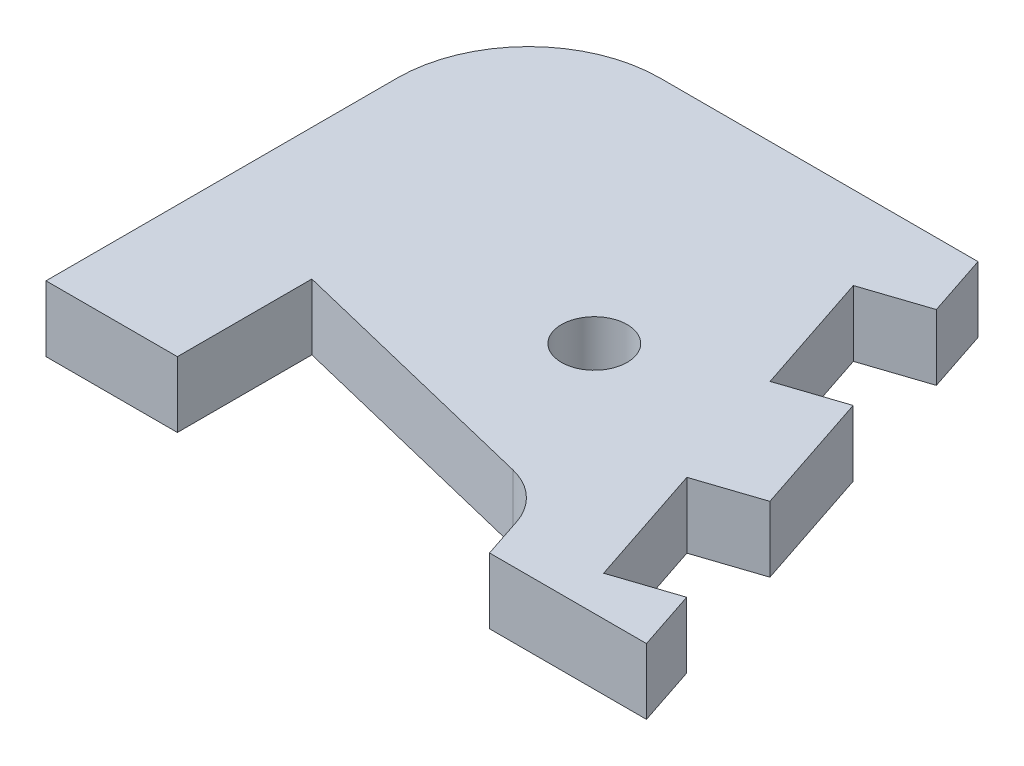
ISO-10303-21;
HEADER;
FILE_DESCRIPTION(('STEP AP214'),'2;1');
FILE_NAME('part.step','',(''),(''),'','','');
FILE_SCHEMA(('AUTOMOTIVE_DESIGN { 1 0 10303 214 1 1 1 1 }'));
ENDSEC;
DATA;
#1=APPLICATION_CONTEXT('core data for automotive mechanical design processes');
#2=APPLICATION_PROTOCOL_DEFINITION('international standard','automotive_design',2000,#1);
#3=PRODUCT_CONTEXT('',#1,'mechanical');
#4=PRODUCT('Part','Part','',(#3));
#5=PRODUCT_RELATED_PRODUCT_CATEGORY('part','',(#4));
#6=PRODUCT_DEFINITION_FORMATION('','',#4);
#7=PRODUCT_DEFINITION_CONTEXT('part definition',#1,'design');
#8=PRODUCT_DEFINITION('design','',#6,#7);
#9=PRODUCT_DEFINITION_SHAPE('','',#8);
#10=(LENGTH_UNIT() NAMED_UNIT(*) SI_UNIT(.MILLI.,.METRE.));
#11=(NAMED_UNIT(*) PLANE_ANGLE_UNIT() SI_UNIT($,.RADIAN.));
#12=(NAMED_UNIT(*) SI_UNIT($,.STERADIAN.) SOLID_ANGLE_UNIT());
#13=UNCERTAINTY_MEASURE_WITH_UNIT(LENGTH_MEASURE(1.E-05),#10,'distance_accuracy_value','');
#14=(GEOMETRIC_REPRESENTATION_CONTEXT(3) GLOBAL_UNCERTAINTY_ASSIGNED_CONTEXT((#13)) GLOBAL_UNIT_ASSIGNED_CONTEXT((#10,
#11,#12)) REPRESENTATION_CONTEXT('',''));
#15=CARTESIAN_POINT('',(0.,0.,0.));
#16=DIRECTION('',(0.,0.,1.));
#17=DIRECTION('',(1.,0.,0.));
#18=AXIS2_PLACEMENT_3D('',#15,#16,#17);
#19=CARTESIAN_POINT('',(43.5360100522409,10.,35.5951480288893));
#20=DIRECTION('',(-0.948960459172505,0.,0.315395064842665));
#21=DIRECTION('',(0.315395064842665,0.,0.948960459172505));
#22=AXIS2_PLACEMENT_3D('',#19,#20,#21);
#23=PLANE('',#22);
#24=DIRECTION('',(-0.315395064842665,0.,-0.948960459172505));
#25=VECTOR('',#24,1.);
#26=CARTESIAN_POINT('',(43.5360100522409,0.,35.5951480288893));
#27=LINE('',#26,#25);
#28=CARTESIAN_POINT('',(43.5360100522409,0.,35.5951480288893));
#29=VERTEX_POINT('',#28);
#30=CARTESIAN_POINT('',(40.4889753758803,0.,26.4272321420753));
#31=VERTEX_POINT('',#30);
#32=EDGE_CURVE('E185',#29,#31,#27,.T.);
#33=ORIENTED_EDGE('',*,*,#32,.T.);
#34=DIRECTION('',(0.,1.,0.));
#35=VECTOR('',#34,1.);
#36=CARTESIAN_POINT('',(40.4889753758803,0.,26.4272321420753));
#37=LINE('',#36,#35);
#38=CARTESIAN_POINT('',(40.4889753758803,10.,26.4272321420753));
#39=VERTEX_POINT('',#38);
#40=EDGE_CURVE('E276',#31,#39,#37,.T.);
#41=ORIENTED_EDGE('',*,*,#40,.T.);
#42=DIRECTION('',(-0.315395064842665,0.,-0.948960459172505));
#43=VECTOR('',#42,1.);
#44=CARTESIAN_POINT('',(43.5360100522409,10.,35.5951480288893));
#45=LINE('',#44,#43);
#46=CARTESIAN_POINT('',(43.5360100522409,10.,35.5951480288893));
#47=VERTEX_POINT('',#46);
#48=EDGE_CURVE('E263',#47,#39,#45,.T.);
#49=ORIENTED_EDGE('',*,*,#48,.F.);
#50=DIRECTION('',(0.,-1.,0.));
#51=VECTOR('',#50,1.);
#52=CARTESIAN_POINT('',(43.5360100522409,10.,35.5951480288893));
#53=LINE('',#52,#51);
#54=EDGE_CURVE('E199',#47,#29,#53,.T.);
#55=ORIENTED_EDGE('',*,*,#54,.T.);
#56=EDGE_LOOP('',(#33,#41,#49,#55));
#57=FACE_BOUND('',#56,.T.);
#58=ADVANCED_FACE('F33',(#57),#23,.F.);
#59=CARTESIAN_POINT('',(34.181074079027,10.,7.44802295862521));
#60=VERTEX_POINT('',#59);
#61=CARTESIAN_POINT('',(27.8731727821737,10.,-11.5311862248249));
#62=VERTEX_POINT('',#61);
#63=EDGE_CURVE('E176',#60,#62,#45,.T.);
#64=ORIENTED_EDGE('',*,*,#63,.F.);
#65=DIRECTION('',(0.,1.,0.));
#66=VECTOR('',#65,1.);
#67=CARTESIAN_POINT('',(34.181074079027,0.,7.44802295862521));
#68=LINE('',#67,#66);
#69=CARTESIAN_POINT('',(34.181074079027,0.,7.44802295862521));
#70=VERTEX_POINT('',#69);
#71=EDGE_CURVE('E162',#70,#60,#68,.T.);
#72=ORIENTED_EDGE('',*,*,#71,.F.);
#73=CARTESIAN_POINT('',(27.8731727821737,0.,-11.5311862248249));
#74=VERTEX_POINT('',#73);
#75=EDGE_CURVE('E174',#70,#74,#27,.T.);
#76=ORIENTED_EDGE('',*,*,#75,.T.);
#77=DIRECTION('',(0.,1.,0.));
#78=VECTOR('',#77,1.);
#79=CARTESIAN_POINT('',(27.8731727821737,0.,-11.5311862248249));
#80=LINE('',#79,#78);
#81=EDGE_CURVE('E297',#74,#62,#80,.T.);
#82=ORIENTED_EDGE('',*,*,#81,.T.);
#83=EDGE_LOOP('',(#64,#72,#76,#82));
#84=FACE_BOUND('',#83,.T.);
#85=ADVANCED_FACE('F172',(#84),#23,.F.);
#86=CARTESIAN_POINT('',(8.10437226417191,10.,32.5780480350778));
#87=DIRECTION('',(0.,-1.,0.));
#88=DIRECTION('',(0.,0.,-1.));
#89=AXIS2_PLACEMENT_3D('',#86,#87,#88);
#90=PLANE('',#89);
#91=DIRECTION('',(-1.,0.,0.));
#92=VECTOR('',#91,1.);
#93=CARTESIAN_POINT('',(-50.,10.,-40.));
#94=LINE('',#93,#92);
#95=CARTESIAN_POINT('',(18.4113208368937,10.,-40.));
#96=VERTEX_POINT('',#95);
#97=CARTESIAN_POINT('',(-30.,10.,-40.));
#98=VERTEX_POINT('',#97);
#99=EDGE_CURVE('E200',#96,#98,#94,.T.);
#100=ORIENTED_EDGE('',*,*,#99,.T.);
#101=CARTESIAN_POINT('',(-30.,10.,-20.));
#102=DIRECTION('',(0.,-1.,0.));
#103=DIRECTION('',(0.,0.,-1.));
#104=AXIS2_PLACEMENT_3D('',#101,#102,#103);
#105=CIRCLE('',#104,20.);
#106=CARTESIAN_POINT('',(-50.,10.,-20.));
#107=VERTEX_POINT('',#106);
#108=EDGE_CURVE('E11',#98,#107,#105,.F.);
#109=ORIENTED_EDGE('',*,*,#108,.T.);
#110=DIRECTION('',(0.,0.,1.));
#111=VECTOR('',#110,1.);
#112=CARTESIAN_POINT('',(-50.,10.,-40.));
#113=LINE('',#112,#111);
#114=CARTESIAN_POINT('',(-50.,10.,33.4741605090196));
#115=VERTEX_POINT('',#114);
#116=EDGE_CURVE('E195',#107,#115,#113,.T.);
#117=ORIENTED_EDGE('',*,*,#116,.T.);
#118=DIRECTION('',(1.,0.,0.));
#119=VECTOR('',#118,1.);
#120=CARTESIAN_POINT('',(-50.,10.,33.4741605090196));
#121=LINE('',#120,#119);
#122=CARTESIAN_POINT('',(-29.9999999999998,10.,33.4741605090196));
#123=VERTEX_POINT('',#122);
#124=EDGE_CURVE('E307',#115,#123,#121,.T.);
#125=ORIENTED_EDGE('',*,*,#124,.T.);
#126=DIRECTION('',(0.,0.,-1.));
#127=VECTOR('',#126,1.);
#128=CARTESIAN_POINT('',(-29.9999999999998,10.,13.));
#129=LINE('',#128,#127);
#130=CARTESIAN_POINT('',(-29.9999999999998,10.,13.));
#131=VERTEX_POINT('',#130);
#132=EDGE_CURVE('E309',#123,#131,#129,.T.);
#133=ORIENTED_EDGE('',*,*,#132,.T.);
#134=DIRECTION('',(0.971569206394266,0.,0.236755733164829));
#135=VECTOR('',#134,1.);
#136=CARTESIAN_POINT('',(-29.9999999999998,10.,13.));
#137=LINE('',#136,#135);
#138=CARTESIAN_POINT('',(10.4719295958201,10.,22.8623559711352));
#139=VERTEX_POINT('',#138);
#140=EDGE_CURVE('E311',#131,#139,#137,.T.);
#141=ORIENTED_EDGE('',*,*,#140,.T.);
#142=CARTESIAN_POINT('',(8.10437226417191,10.,32.5780480350778));
#143=DIRECTION('',(0.,-1.,0.));
#144=DIRECTION('',(0.,0.,-1.));
#145=AXIS2_PLACEMENT_3D('',#142,#143,#144);
#146=CIRCLE('',#145,9.99999999999988);
#147=CARTESIAN_POINT('',(17.5939768558969,10.,29.4240973866513));
#148=VERTEX_POINT('',#147);
#149=EDGE_CURVE('E313',#139,#148,#146,.T.);
#150=ORIENTED_EDGE('',*,*,#149,.T.);
#151=DIRECTION('',(0.315395064842665,0.,0.948960459172504));
#152=VECTOR('',#151,1.);
#153=CARTESIAN_POINT('',(17.5939768558969,10.,29.4240973866513));
#154=LINE('',#153,#152);
#155=CARTESIAN_POINT('',(19.6449779262188,10.,35.5951480288893));
#156=VERTEX_POINT('',#155);
#157=EDGE_CURVE('E315',#148,#156,#154,.T.);
#158=ORIENTED_EDGE('',*,*,#157,.T.);
#159=DIRECTION('',(1.,0.,0.));
#160=VECTOR('',#159,1.);
#161=CARTESIAN_POINT('',(19.6449779262188,10.,35.5951480288893));
#162=LINE('',#161,#160);
#163=EDGE_CURVE('E317',#156,#47,#162,.T.);
#164=ORIENTED_EDGE('',*,*,#163,.T.);
#165=ORIENTED_EDGE('',*,*,#48,.T.);
#166=DIRECTION('',(0.948960459172505,0.,-0.315395064842665));
#167=VECTOR('',#166,1.);
#168=CARTESIAN_POINT('',(30.9993707841552,10.,29.581182790502));
#169=LINE('',#168,#167);
#170=CARTESIAN_POINT('',(30.9993707841552,10.,29.581182790502));
#171=VERTEX_POINT('',#170);
#172=EDGE_CURVE('E168',#171,#39,#169,.T.);
#173=ORIENTED_EDGE('',*,*,#172,.F.);
#174=DIRECTION('',(0.315395064842665,0.,0.948960459172505));
#175=VECTOR('',#174,1.);
#176=CARTESIAN_POINT('',(24.6914694873019,10.,10.6019736070519));
#177=LINE('',#176,#175);
#178=CARTESIAN_POINT('',(24.6914694873019,10.,10.6019736070519));
#179=VERTEX_POINT('',#178);
#180=EDGE_CURVE('E272',#179,#171,#177,.T.);
#181=ORIENTED_EDGE('',*,*,#180,.F.);
#182=DIRECTION('',(-0.948960459172505,0.,0.315395064842665));
#183=VECTOR('',#182,1.);
#184=CARTESIAN_POINT('',(34.181074079027,10.,7.44802295862521));
#185=LINE('',#184,#183);
#186=EDGE_CURVE('E270',#60,#179,#185,.T.);
#187=ORIENTED_EDGE('',*,*,#186,.F.);
#188=ORIENTED_EDGE('',*,*,#63,.T.);
#189=DIRECTION('',(0.948960459172505,0.,-0.315395064842665));
#190=VECTOR('',#189,1.);
#191=CARTESIAN_POINT('',(18.3835681904486,10.,-8.37723557639823));
#192=LINE('',#191,#190);
#193=CARTESIAN_POINT('',(18.3835681904486,10.,-8.37723557639823));
#194=VERTEX_POINT('',#193);
#195=EDGE_CURVE('E286',#194,#62,#192,.T.);
#196=ORIENTED_EDGE('',*,*,#195,.F.);
#197=DIRECTION('',(0.315395064842665,0.,0.948960459172505));
#198=VECTOR('',#197,1.);
#199=CARTESIAN_POINT('',(12.0756668935953,10.,-27.3564447598483));
#200=LINE('',#199,#198);
#201=CARTESIAN_POINT('',(12.0756668935953,10.,-27.3564447598483));
#202=VERTEX_POINT('',#201);
#203=EDGE_CURVE('E292',#202,#194,#200,.T.);
#204=ORIENTED_EDGE('',*,*,#203,.F.);
#205=DIRECTION('',(-0.948960459172505,0.,0.315395064842665));
#206=VECTOR('',#205,1.);
#207=CARTESIAN_POINT('',(21.5652714853204,10.,-30.510395408275));
#208=LINE('',#207,#206);
#209=CARTESIAN_POINT('',(21.5652714853204,10.,-30.510395408275));
#210=VERTEX_POINT('',#209);
#211=EDGE_CURVE('E278',#210,#202,#208,.T.);
#212=ORIENTED_EDGE('',*,*,#211,.F.);
#213=EDGE_CURVE('E318',#210,#96,#45,.T.);
#214=ORIENTED_EDGE('',*,*,#213,.T.);
#215=EDGE_LOOP('',(#100,#109,#117,#125,#133,#141,#150,#158,#164,#165,#173,#181,#187,#188,#196,
#204,#212,#214));
#216=FACE_BOUND('',#215,.T.);
#217=CARTESIAN_POINT('',(0.,10.,0.));
#218=DIRECTION('',(0.,1.,0.));
#219=DIRECTION('',(0.,0.,1.));
#220=AXIS2_PLACEMENT_3D('',#217,#218,#219);
#221=CIRCLE('',#220,5.);
#222=CARTESIAN_POINT('',(0.,10.,5.));
#223=VERTEX_POINT('',#222);
#224=EDGE_CURVE('E235',#223,#223,#221,.T.);
#225=ORIENTED_EDGE('',*,*,#224,.F.);
#226=EDGE_LOOP('',(#225));
#227=FACE_BOUND('',#226,.T.);
#228=ADVANCED_FACE('F324',(#216,#227),#90,.F.);
#229=CARTESIAN_POINT('',(8.10437226417191,0.,32.5780480350778));
#230=DIRECTION('',(0.,-1.,0.));
#231=DIRECTION('',(0.,0.,-1.));
#232=AXIS2_PLACEMENT_3D('',#229,#230,#231);
#233=PLANE('',#232);
#234=DIRECTION('',(0.,0.,1.));
#235=VECTOR('',#234,1.);
#236=CARTESIAN_POINT('',(-50.,0.,13.));
#237=LINE('',#236,#235);
#238=CARTESIAN_POINT('',(-50.,0.,-20.));
#239=VERTEX_POINT('',#238);
#240=CARTESIAN_POINT('',(-50.,0.,33.4741605090196));
#241=VERTEX_POINT('',#240);
#242=EDGE_CURVE('E229',#239,#241,#237,.T.);
#243=ORIENTED_EDGE('',*,*,#242,.F.);
#244=CARTESIAN_POINT('',(-30.,0.,-20.));
#245=DIRECTION('',(0.,-1.,0.));
#246=DIRECTION('',(0.,0.,-1.));
#247=AXIS2_PLACEMENT_3D('',#244,#245,#246);
#248=CIRCLE('',#247,20.);
#249=CARTESIAN_POINT('',(-30.,0.,-40.));
#250=VERTEX_POINT('',#249);
#251=EDGE_CURVE('E55',#239,#250,#248,.T.);
#252=ORIENTED_EDGE('',*,*,#251,.T.);
#253=DIRECTION('',(-1.,0.,0.));
#254=VECTOR('',#253,1.);
#255=CARTESIAN_POINT('',(-50.,0.,-40.));
#256=LINE('',#255,#254);
#257=CARTESIAN_POINT('',(18.4113208368937,0.,-40.));
#258=VERTEX_POINT('',#257);
#259=EDGE_CURVE('E189',#258,#250,#256,.T.);
#260=ORIENTED_EDGE('',*,*,#259,.F.);
#261=CARTESIAN_POINT('',(21.5652714853204,0.,-30.510395408275));
#262=VERTEX_POINT('',#261);
#263=EDGE_CURVE('E186',#262,#258,#27,.T.);
#264=ORIENTED_EDGE('',*,*,#263,.F.);
#265=DIRECTION('',(-0.948960459172505,0.,0.315395064842665));
#266=VECTOR('',#265,1.);
#267=CARTESIAN_POINT('',(21.5652714853204,0.,-30.510395408275));
#268=LINE('',#267,#266);
#269=CARTESIAN_POINT('',(12.0756668935953,0.,-27.3564447598483));
#270=VERTEX_POINT('',#269);
#271=EDGE_CURVE('E282',#262,#270,#268,.T.);
#272=ORIENTED_EDGE('',*,*,#271,.T.);
#273=DIRECTION('',(0.315395064842665,0.,0.948960459172505));
#274=VECTOR('',#273,1.);
#275=CARTESIAN_POINT('',(12.0756668935953,0.,-27.3564447598483));
#276=LINE('',#275,#274);
#277=CARTESIAN_POINT('',(18.3835681904486,0.,-8.37723557639823));
#278=VERTEX_POINT('',#277);
#279=EDGE_CURVE('E285',#270,#278,#276,.T.);
#280=ORIENTED_EDGE('',*,*,#279,.T.);
#281=DIRECTION('',(0.948960459172505,0.,-0.315395064842665));
#282=VECTOR('',#281,1.);
#283=CARTESIAN_POINT('',(18.3835681904486,0.,-8.37723557639823));
#284=LINE('',#283,#282);
#285=EDGE_CURVE('E184',#278,#74,#284,.T.);
#286=ORIENTED_EDGE('',*,*,#285,.T.);
#287=ORIENTED_EDGE('',*,*,#75,.F.);
#288=DIRECTION('',(-0.948960459172505,0.,0.315395064842665));
#289=VECTOR('',#288,1.);
#290=CARTESIAN_POINT('',(34.181074079027,0.,7.44802295862521));
#291=LINE('',#290,#289);
#292=CARTESIAN_POINT('',(24.6914694873019,0.,10.6019736070519));
#293=VERTEX_POINT('',#292);
#294=EDGE_CURVE('E158',#70,#293,#291,.T.);
#295=ORIENTED_EDGE('',*,*,#294,.T.);
#296=DIRECTION('',(0.315395064842665,0.,0.948960459172505));
#297=VECTOR('',#296,1.);
#298=CARTESIAN_POINT('',(24.6914694873019,0.,10.6019736070519));
#299=LINE('',#298,#297);
#300=CARTESIAN_POINT('',(30.9993707841552,0.,29.581182790502));
#301=VERTEX_POINT('',#300);
#302=EDGE_CURVE('E167',#293,#301,#299,.T.);
#303=ORIENTED_EDGE('',*,*,#302,.T.);
#304=DIRECTION('',(0.948960459172505,0.,-0.315395064842665));
#305=VECTOR('',#304,1.);
#306=CARTESIAN_POINT('',(30.9993707841552,0.,29.581182790502));
#307=LINE('',#306,#305);
#308=EDGE_CURVE('E177',#301,#31,#307,.T.);
#309=ORIENTED_EDGE('',*,*,#308,.T.);
#310=ORIENTED_EDGE('',*,*,#32,.F.);
#311=DIRECTION('',(1.,0.,0.));
#312=VECTOR('',#311,1.);
#313=CARTESIAN_POINT('',(19.6449779262188,0.,35.5951480288893));
#314=LINE('',#313,#312);
#315=CARTESIAN_POINT('',(19.6449779262188,0.,35.5951480288893));
#316=VERTEX_POINT('',#315);
#317=EDGE_CURVE('E190',#316,#29,#314,.T.);
#318=ORIENTED_EDGE('',*,*,#317,.F.);
#319=DIRECTION('',(0.315395064842665,0.,0.948960459172504));
#320=VECTOR('',#319,1.);
#321=CARTESIAN_POINT('',(17.5939768558969,0.,29.4240973866513));
#322=LINE('',#321,#320);
#323=CARTESIAN_POINT('',(17.5939768558969,0.,29.4240973866513));
#324=VERTEX_POINT('',#323);
#325=EDGE_CURVE('E249',#324,#316,#322,.T.);
#326=ORIENTED_EDGE('',*,*,#325,.F.);
#327=CARTESIAN_POINT('',(8.10437226417191,0.,32.5780480350778));
#328=DIRECTION('',(0.,-1.,0.));
#329=DIRECTION('',(0.,0.,-1.));
#330=AXIS2_PLACEMENT_3D('',#327,#328,#329);
#331=CIRCLE('',#330,9.99999999999988);
#332=CARTESIAN_POINT('',(10.4719295958201,0.,22.8623559711352));
#333=VERTEX_POINT('',#332);
#334=EDGE_CURVE('E248',#333,#324,#331,.T.);
#335=ORIENTED_EDGE('',*,*,#334,.F.);
#336=DIRECTION('',(0.971569206394266,0.,0.236755733164829));
#337=VECTOR('',#336,1.);
#338=CARTESIAN_POINT('',(-29.9999999999998,0.,13.));
#339=LINE('',#338,#337);
#340=CARTESIAN_POINT('',(-29.9999999999998,0.,13.));
#341=VERTEX_POINT('',#340);
#342=EDGE_CURVE('E246',#341,#333,#339,.T.);
#343=ORIENTED_EDGE('',*,*,#342,.F.);
#344=DIRECTION('',(0.,0.,-1.));
#345=VECTOR('',#344,1.);
#346=CARTESIAN_POINT('',(-29.9999999999998,0.,13.));
#347=LINE('',#346,#345);
#348=CARTESIAN_POINT('',(-29.9999999999998,0.,33.4741605090196));
#349=VERTEX_POINT('',#348);
#350=EDGE_CURVE('E237',#349,#341,#347,.T.);
#351=ORIENTED_EDGE('',*,*,#350,.F.);
#352=DIRECTION('',(1.,0.,0.));
#353=VECTOR('',#352,1.);
#354=CARTESIAN_POINT('',(-50.,0.,33.4741605090196));
#355=LINE('',#354,#353);
#356=EDGE_CURVE('E234',#241,#349,#355,.T.);
#357=ORIENTED_EDGE('',*,*,#356,.F.);
#358=EDGE_LOOP('',(#243,#252,#260,#264,#272,#280,#286,#287,#295,#303,#309,#310,#318,#326,#335,
#343,#351,#357));
#359=FACE_BOUND('',#358,.T.);
#360=CARTESIAN_POINT('',(0.,0.,0.));
#361=DIRECTION('',(0.,1.,0.));
#362=DIRECTION('',(0.,0.,1.));
#363=AXIS2_PLACEMENT_3D('',#360,#361,#362);
#364=CIRCLE('',#363,5.);
#365=CARTESIAN_POINT('',(0.,0.,5.));
#366=VERTEX_POINT('',#365);
#367=EDGE_CURVE('E240',#366,#366,#364,.T.);
#368=ORIENTED_EDGE('',*,*,#367,.T.);
#369=EDGE_LOOP('',(#368));
#370=FACE_BOUND('',#369,.T.);
#371=ADVANCED_FACE('F180',(#359,#370),#233,.T.);
#372=CARTESIAN_POINT('',(-50.,10.,13.));
#373=DIRECTION('',(1.,0.,0.));
#374=DIRECTION('',(0.,0.,-1.));
#375=AXIS2_PLACEMENT_3D('',#372,#373,#374);
#376=PLANE('',#375);
#377=ORIENTED_EDGE('',*,*,#116,.F.);
#378=DIRECTION('',(0.,-1.,0.));
#379=VECTOR('',#378,1.);
#380=CARTESIAN_POINT('',(-50.,10.,-20.));
#381=LINE('',#380,#379);
#382=EDGE_CURVE('E221',#107,#239,#381,.T.);
#383=ORIENTED_EDGE('',*,*,#382,.T.);
#384=ORIENTED_EDGE('',*,*,#242,.T.);
#385=DIRECTION('',(0.,-1.,0.));
#386=VECTOR('',#385,1.);
#387=CARTESIAN_POINT('',(-50.,10.,33.4741605090196));
#388=LINE('',#387,#386);
#389=EDGE_CURVE('E218',#115,#241,#388,.T.);
#390=ORIENTED_EDGE('',*,*,#389,.F.);
#391=EDGE_LOOP('',(#377,#383,#384,#390));
#392=FACE_BOUND('',#391,.T.);
#393=ADVANCED_FACE('F227',(#392),#376,.F.);
#394=CARTESIAN_POINT('',(-50.,10.,33.4741605090196));
#395=DIRECTION('',(0.,0.,-1.));
#396=DIRECTION('',(-1.,0.,0.));
#397=AXIS2_PLACEMENT_3D('',#394,#395,#396);
#398=PLANE('',#397);
#399=ORIENTED_EDGE('',*,*,#356,.T.);
#400=DIRECTION('',(0.,-1.,0.));
#401=VECTOR('',#400,1.);
#402=CARTESIAN_POINT('',(-29.9999999999998,10.,33.4741605090196));
#403=LINE('',#402,#401);
#404=EDGE_CURVE('E215',#123,#349,#403,.T.);
#405=ORIENTED_EDGE('',*,*,#404,.F.);
#406=ORIENTED_EDGE('',*,*,#124,.F.);
#407=ORIENTED_EDGE('',*,*,#389,.T.);
#408=EDGE_LOOP('',(#399,#405,#406,#407));
#409=FACE_BOUND('',#408,.T.);
#410=ADVANCED_FACE('F365',(#409),#398,.F.);
#411=CARTESIAN_POINT('',(-29.9999999999998,10.,13.));
#412=DIRECTION('',(-1.,0.,0.));
#413=DIRECTION('',(0.,0.,1.));
#414=AXIS2_PLACEMENT_3D('',#411,#412,#413);
#415=PLANE('',#414);
#416=ORIENTED_EDGE('',*,*,#350,.T.);
#417=DIRECTION('',(0.,-1.,0.));
#418=VECTOR('',#417,1.);
#419=CARTESIAN_POINT('',(-29.9999999999998,10.,13.));
#420=LINE('',#419,#418);
#421=EDGE_CURVE('E212',#131,#341,#420,.T.);
#422=ORIENTED_EDGE('',*,*,#421,.F.);
#423=ORIENTED_EDGE('',*,*,#132,.F.);
#424=ORIENTED_EDGE('',*,*,#404,.T.);
#425=EDGE_LOOP('',(#416,#422,#423,#424));
#426=FACE_BOUND('',#425,.T.);
#427=ADVANCED_FACE('F361',(#426),#415,.F.);
#428=CARTESIAN_POINT('',(-29.9999999999998,10.,13.));
#429=DIRECTION('',(0.236755733164829,0.,-0.971569206394266));
#430=DIRECTION('',(-0.971569206394266,0.,-0.236755733164829));
#431=AXIS2_PLACEMENT_3D('',#428,#429,#430);
#432=PLANE('',#431);
#433=ORIENTED_EDGE('',*,*,#342,.T.);
#434=DIRECTION('',(0.,-1.,0.));
#435=VECTOR('',#434,1.);
#436=CARTESIAN_POINT('',(10.4719295958201,10.,22.8623559711352));
#437=LINE('',#436,#435);
#438=EDGE_CURVE('E209',#139,#333,#437,.T.);
#439=ORIENTED_EDGE('',*,*,#438,.F.);
#440=ORIENTED_EDGE('',*,*,#140,.F.);
#441=ORIENTED_EDGE('',*,*,#421,.T.);
#442=EDGE_LOOP('',(#433,#439,#440,#441));
#443=FACE_BOUND('',#442,.T.);
#444=ADVANCED_FACE('F357',(#443),#432,.F.);
#445=CARTESIAN_POINT('',(8.10437226417191,10.,32.5780480350778));
#446=DIRECTION('',(0.,-1.,0.));
#447=DIRECTION('',(0.,0.,-1.));
#448=AXIS2_PLACEMENT_3D('',#445,#446,#447);
#449=CYLINDRICAL_SURFACE('',#448,9.99999999999988);
#450=ORIENTED_EDGE('',*,*,#334,.T.);
#451=DIRECTION('',(0.,-1.,0.));
#452=VECTOR('',#451,1.);
#453=CARTESIAN_POINT('',(17.5939768558969,10.,29.4240973866513));
#454=LINE('',#453,#452);
#455=EDGE_CURVE('E206',#148,#324,#454,.T.);
#456=ORIENTED_EDGE('',*,*,#455,.F.);
#457=ORIENTED_EDGE('',*,*,#149,.F.);
#458=ORIENTED_EDGE('',*,*,#438,.T.);
#459=EDGE_LOOP('',(#450,#456,#457,#458));
#460=FACE_BOUND('',#459,.T.);
#461=ADVANCED_FACE('F354',(#460),#449,.F.);
#462=CARTESIAN_POINT('',(17.5939768558969,10.,29.4240973866513));
#463=DIRECTION('',(0.948960459172505,0.,-0.315395064842665));
#464=DIRECTION('',(-0.315395064842665,0.,-0.948960459172505));
#465=AXIS2_PLACEMENT_3D('',#462,#463,#464);
#466=PLANE('',#465);
#467=ORIENTED_EDGE('',*,*,#325,.T.);
#468=DIRECTION('',(0.,-1.,0.));
#469=VECTOR('',#468,1.);
#470=CARTESIAN_POINT('',(19.6449779262188,10.,35.5951480288893));
#471=LINE('',#470,#469);
#472=EDGE_CURVE('E203',#156,#316,#471,.T.);
#473=ORIENTED_EDGE('',*,*,#472,.F.);
#474=ORIENTED_EDGE('',*,*,#157,.F.);
#475=ORIENTED_EDGE('',*,*,#455,.T.);
#476=EDGE_LOOP('',(#467,#473,#474,#475));
#477=FACE_BOUND('',#476,.T.);
#478=ADVANCED_FACE('F351',(#477),#466,.F.);
#479=CARTESIAN_POINT('',(19.6449779262188,10.,35.5951480288893));
#480=DIRECTION('',(0.,0.,-1.));
#481=DIRECTION('',(-1.,0.,0.));
#482=AXIS2_PLACEMENT_3D('',#479,#480,#481);
#483=PLANE('',#482);
#484=ORIENTED_EDGE('',*,*,#317,.T.);
#485=ORIENTED_EDGE('',*,*,#54,.F.);
#486=ORIENTED_EDGE('',*,*,#163,.F.);
#487=ORIENTED_EDGE('',*,*,#472,.T.);
#488=EDGE_LOOP('',(#484,#485,#486,#487));
#489=FACE_BOUND('',#488,.T.);
#490=ADVANCED_FACE('F256',(#489),#483,.F.);
#491=ORIENTED_EDGE('',*,*,#213,.F.);
#492=DIRECTION('',(0.,1.,0.));
#493=VECTOR('',#492,1.);
#494=CARTESIAN_POINT('',(21.5652714853204,0.,-30.510395408275));
#495=LINE('',#494,#493);
#496=EDGE_CURVE('E289',#262,#210,#495,.T.);
#497=ORIENTED_EDGE('',*,*,#496,.F.);
#498=ORIENTED_EDGE('',*,*,#263,.T.);
#499=DIRECTION('',(0.,-1.,0.));
#500=VECTOR('',#499,1.);
#501=CARTESIAN_POINT('',(18.4113208368937,10.,-40.));
#502=LINE('',#501,#500);
#503=EDGE_CURVE('E196',#96,#258,#502,.T.);
#504=ORIENTED_EDGE('',*,*,#503,.F.);
#505=EDGE_LOOP('',(#491,#497,#498,#504));
#506=FACE_BOUND('',#505,.T.);
#507=ADVANCED_FACE('F329',(#506),#23,.F.);
#508=CARTESIAN_POINT('',(-50.,10.,-40.));
#509=DIRECTION('',(0.,0.,1.));
#510=DIRECTION('',(1.,0.,0.));
#511=AXIS2_PLACEMENT_3D('',#508,#509,#510);
#512=PLANE('',#511);
#513=ORIENTED_EDGE('',*,*,#259,.T.);
#514=DIRECTION('',(0.,-1.,0.));
#515=VECTOR('',#514,1.);
#516=CARTESIAN_POINT('',(-30.,10.,-40.));
#517=LINE('',#516,#515);
#518=EDGE_CURVE('E41',#250,#98,#517,.F.);
#519=ORIENTED_EDGE('',*,*,#518,.T.);
#520=ORIENTED_EDGE('',*,*,#99,.F.);
#521=ORIENTED_EDGE('',*,*,#503,.T.);
#522=EDGE_LOOP('',(#513,#519,#520,#521));
#523=FACE_BOUND('',#522,.T.);
#524=ADVANCED_FACE('F331',(#523),#512,.F.);
#525=CARTESIAN_POINT('',(0.,10.,0.));
#526=DIRECTION('',(0.,-1.,0.));
#527=DIRECTION('',(0.,0.,-1.));
#528=AXIS2_PLACEMENT_3D('',#525,#526,#527);
#529=CYLINDRICAL_SURFACE('',#528,5.);
#530=ORIENTED_EDGE('',*,*,#224,.T.);
#531=EDGE_LOOP('',(#530));
#532=FACE_BOUND('',#531,.T.);
#533=ORIENTED_EDGE('',*,*,#367,.F.);
#534=EDGE_LOOP('',(#533));
#535=FACE_BOUND('',#534,.T.);
#536=ADVANCED_FACE('F333',(#532,#535),#529,.F.);
#537=CARTESIAN_POINT('',(18.3835681904486,0.,-8.37723557639823));
#538=DIRECTION('',(0.315395064842665,0.,0.948960459172505));
#539=DIRECTION('',(0.948960459172505,0.,-0.315395064842665));
#540=AXIS2_PLACEMENT_3D('',#537,#538,#539);
#541=PLANE('',#540);
#542=ORIENTED_EDGE('',*,*,#195,.T.);
#543=ORIENTED_EDGE('',*,*,#81,.F.);
#544=ORIENTED_EDGE('',*,*,#285,.F.);
#545=DIRECTION('',(0.,1.,0.));
#546=VECTOR('',#545,1.);
#547=CARTESIAN_POINT('',(18.3835681904486,0.,-8.37723557639823));
#548=LINE('',#547,#546);
#549=EDGE_CURVE('E299',#278,#194,#548,.T.);
#550=ORIENTED_EDGE('',*,*,#549,.T.);
#551=EDGE_LOOP('',(#542,#543,#544,#550));
#552=FACE_BOUND('',#551,.T.);
#553=ADVANCED_FACE('F339',(#552),#541,.F.);
#554=CARTESIAN_POINT('',(12.0756668935953,0.,-27.3564447598483));
#555=DIRECTION('',(-0.948960459172505,0.,0.315395064842665));
#556=DIRECTION('',(0.315395064842665,0.,0.948960459172505));
#557=AXIS2_PLACEMENT_3D('',#554,#555,#556);
#558=PLANE('',#557);
#559=ORIENTED_EDGE('',*,*,#203,.T.);
#560=ORIENTED_EDGE('',*,*,#549,.F.);
#561=ORIENTED_EDGE('',*,*,#279,.F.);
#562=DIRECTION('',(0.,1.,0.));
#563=VECTOR('',#562,1.);
#564=CARTESIAN_POINT('',(12.0756668935953,0.,-27.3564447598483));
#565=LINE('',#564,#563);
#566=EDGE_CURVE('E301',#270,#202,#565,.T.);
#567=ORIENTED_EDGE('',*,*,#566,.T.);
#568=EDGE_LOOP('',(#559,#560,#561,#567));
#569=FACE_BOUND('',#568,.T.);
#570=ADVANCED_FACE('F382',(#569),#558,.F.);
#571=CARTESIAN_POINT('',(21.5652714853204,0.,-30.510395408275));
#572=DIRECTION('',(-0.315395064842665,0.,-0.948960459172505));
#573=DIRECTION('',(-0.948960459172505,0.,0.315395064842665));
#574=AXIS2_PLACEMENT_3D('',#571,#572,#573);
#575=PLANE('',#574);
#576=ORIENTED_EDGE('',*,*,#211,.T.);
#577=ORIENTED_EDGE('',*,*,#566,.F.);
#578=ORIENTED_EDGE('',*,*,#271,.F.);
#579=ORIENTED_EDGE('',*,*,#496,.T.);
#580=EDGE_LOOP('',(#576,#577,#578,#579));
#581=FACE_BOUND('',#580,.T.);
#582=ADVANCED_FACE('F378',(#581),#575,.F.);
#583=CARTESIAN_POINT('',(30.9993707841552,0.,29.581182790502));
#584=DIRECTION('',(0.315395064842665,0.,0.948960459172505));
#585=DIRECTION('',(0.948960459172505,0.,-0.315395064842665));
#586=AXIS2_PLACEMENT_3D('',#583,#584,#585);
#587=PLANE('',#586);
#588=ORIENTED_EDGE('',*,*,#172,.T.);
#589=ORIENTED_EDGE('',*,*,#40,.F.);
#590=ORIENTED_EDGE('',*,*,#308,.F.);
#591=DIRECTION('',(0.,1.,0.));
#592=VECTOR('',#591,1.);
#593=CARTESIAN_POINT('',(30.9993707841552,0.,29.581182790502));
#594=LINE('',#593,#592);
#595=EDGE_CURVE('E279',#301,#171,#594,.T.);
#596=ORIENTED_EDGE('',*,*,#595,.T.);
#597=EDGE_LOOP('',(#588,#589,#590,#596));
#598=FACE_BOUND('',#597,.T.);
#599=ADVANCED_FACE('F381',(#598),#587,.F.);
#600=CARTESIAN_POINT('',(24.6914694873019,0.,10.6019736070519));
#601=DIRECTION('',(-0.948960459172505,0.,0.315395064842665));
#602=DIRECTION('',(0.315395064842665,0.,0.948960459172505));
#603=AXIS2_PLACEMENT_3D('',#600,#601,#602);
#604=PLANE('',#603);
#605=ORIENTED_EDGE('',*,*,#180,.T.);
#606=ORIENTED_EDGE('',*,*,#595,.F.);
#607=ORIENTED_EDGE('',*,*,#302,.F.);
#608=DIRECTION('',(0.,1.,0.));
#609=VECTOR('',#608,1.);
#610=CARTESIAN_POINT('',(24.6914694873019,0.,10.6019736070519));
#611=LINE('',#610,#609);
#612=EDGE_CURVE('E164',#293,#179,#611,.T.);
#613=ORIENTED_EDGE('',*,*,#612,.T.);
#614=EDGE_LOOP('',(#605,#606,#607,#613));
#615=FACE_BOUND('',#614,.T.);
#616=ADVANCED_FACE('F392',(#615),#604,.F.);
#617=CARTESIAN_POINT('',(34.181074079027,0.,7.44802295862521));
#618=DIRECTION('',(-0.315395064842665,0.,-0.948960459172505));
#619=DIRECTION('',(-0.948960459172505,0.,0.315395064842665));
#620=AXIS2_PLACEMENT_3D('',#617,#618,#619);
#621=PLANE('',#620);
#622=ORIENTED_EDGE('',*,*,#186,.T.);
#623=ORIENTED_EDGE('',*,*,#612,.F.);
#624=ORIENTED_EDGE('',*,*,#294,.F.);
#625=ORIENTED_EDGE('',*,*,#71,.T.);
#626=EDGE_LOOP('',(#622,#623,#624,#625));
#627=FACE_BOUND('',#626,.T.);
#628=ADVANCED_FACE('F161',(#627),#621,.F.);
#629=CARTESIAN_POINT('',(-30.,10.,-20.));
#630=DIRECTION('',(0.,-1.,0.));
#631=DIRECTION('',(0.,0.,-1.));
#632=AXIS2_PLACEMENT_3D('',#629,#630,#631);
#633=CYLINDRICAL_SURFACE('',#632,20.);
#634=ORIENTED_EDGE('',*,*,#108,.F.);
#635=ORIENTED_EDGE('',*,*,#518,.F.);
#636=ORIENTED_EDGE('',*,*,#251,.F.);
#637=ORIENTED_EDGE('',*,*,#382,.F.);
#638=EDGE_LOOP('',(#634,#635,#636,#637));
#639=FACE_BOUND('',#638,.T.);
#640=ADVANCED_FACE('F35',(#639),#633,.T.);
#641=CLOSED_SHELL('',(#58,#85,#228,#371,#393,#410,#427,#444,#461,#478,#490,#507,#524,#536,#553,
#570,#582,#599,#616,#628,#640));
#642=MANIFOLD_SOLID_BREP('B2',#641);
#643=ADVANCED_BREP_SHAPE_REPRESENTATION('',(#18,#642),#14);
#644=SHAPE_DEFINITION_REPRESENTATION(#9,#643);
ENDSEC;
END-ISO-10303-21;
